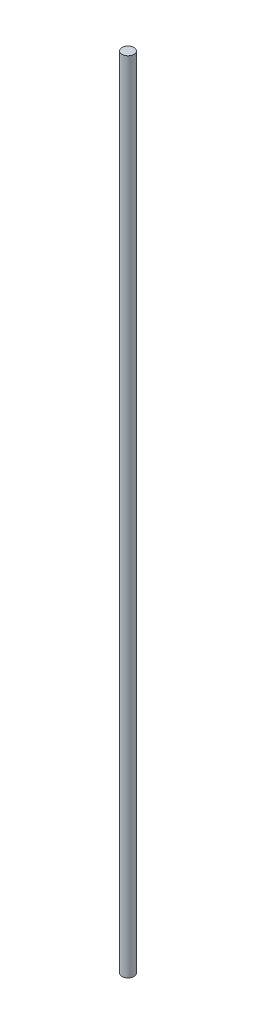
ISO-10303-21;
HEADER;
FILE_DESCRIPTION(('STEP AP214'),'2;1');
FILE_NAME('part.step','',(''),(''),'','','');
FILE_SCHEMA(('AUTOMOTIVE_DESIGN { 1 0 10303 214 1 1 1 1 }'));
ENDSEC;
DATA;
#1=APPLICATION_CONTEXT('core data for automotive mechanical design processes');
#2=APPLICATION_PROTOCOL_DEFINITION('international standard','automotive_design',2000,#1);
#3=PRODUCT_CONTEXT('',#1,'mechanical');
#4=PRODUCT('Part','Part','',(#3));
#5=PRODUCT_RELATED_PRODUCT_CATEGORY('part','',(#4));
#6=PRODUCT_DEFINITION_FORMATION('','',#4);
#7=PRODUCT_DEFINITION_CONTEXT('part definition',#1,'design');
#8=PRODUCT_DEFINITION('design','',#6,#7);
#9=PRODUCT_DEFINITION_SHAPE('','',#8);
#10=(LENGTH_UNIT() NAMED_UNIT(*) SI_UNIT(.MILLI.,.METRE.));
#11=(NAMED_UNIT(*) PLANE_ANGLE_UNIT() SI_UNIT($,.RADIAN.));
#12=(NAMED_UNIT(*) SI_UNIT($,.STERADIAN.) SOLID_ANGLE_UNIT());
#13=UNCERTAINTY_MEASURE_WITH_UNIT(LENGTH_MEASURE(1.E-05),#10,'distance_accuracy_value','');
#14=(GEOMETRIC_REPRESENTATION_CONTEXT(3) GLOBAL_UNCERTAINTY_ASSIGNED_CONTEXT((#13)) GLOBAL_UNIT_ASSIGNED_CONTEXT((#10,
#11,#12)) REPRESENTATION_CONTEXT('',''));
#15=CARTESIAN_POINT('',(0.,0.,0.));
#16=DIRECTION('',(0.,0.,1.));
#17=DIRECTION('',(1.,0.,0.));
#18=AXIS2_PLACEMENT_3D('',#15,#16,#17);
#19=CARTESIAN_POINT('',(0.,99.9999999999994,0.));
#20=DIRECTION('',(0.,-1.,0.));
#21=DIRECTION('',(0.,0.,-1.));
#22=AXIS2_PLACEMENT_3D('',#19,#20,#21);
#23=CYLINDRICAL_SURFACE('',#22,0.75);
#24=CARTESIAN_POINT('',(0.,99.9999999999994,0.));
#25=DIRECTION('',(0.,1.,0.));
#26=DIRECTION('',(0.,0.,1.));
#27=AXIS2_PLACEMENT_3D('',#24,#25,#26);
#28=CIRCLE('',#27,0.75);
#29=CARTESIAN_POINT('',(0.,99.9999999999994,0.75));
#30=VERTEX_POINT('',#29);
#31=EDGE_CURVE('E10',#30,#30,#28,.T.);
#32=ORIENTED_EDGE('',*,*,#31,.F.);
#33=EDGE_LOOP('',(#32));
#34=FACE_BOUND('',#33,.T.);
#35=CARTESIAN_POINT('',(0.,0.,0.));
#36=DIRECTION('',(0.,1.,0.));
#37=DIRECTION('',(0.,0.,1.));
#38=AXIS2_PLACEMENT_3D('',#35,#36,#37);
#39=CIRCLE('',#38,0.75);
#40=CARTESIAN_POINT('',(0.,0.,0.75));
#41=VERTEX_POINT('',#40);
#42=EDGE_CURVE('E40',#41,#41,#39,.T.);
#43=ORIENTED_EDGE('',*,*,#42,.T.);
#44=EDGE_LOOP('',(#43));
#45=FACE_BOUND('',#44,.T.);
#46=ADVANCED_FACE('F37',(#34,#45),#23,.T.);
#47=CARTESIAN_POINT('',(0.,99.9999999999994,0.));
#48=DIRECTION('',(0.,1.,0.));
#49=DIRECTION('',(0.,0.,1.));
#50=AXIS2_PLACEMENT_3D('',#47,#48,#49);
#51=PLANE('',#50);
#52=ORIENTED_EDGE('',*,*,#31,.T.);
#53=EDGE_LOOP('',(#52));
#54=FACE_BOUND('',#53,.T.);
#55=ADVANCED_FACE('F52',(#54),#51,.T.);
#56=CARTESIAN_POINT('',(0.,0.,0.));
#57=DIRECTION('',(0.,1.,0.));
#58=DIRECTION('',(0.,0.,1.));
#59=AXIS2_PLACEMENT_3D('',#56,#57,#58);
#60=PLANE('',#59);
#61=ORIENTED_EDGE('',*,*,#42,.F.);
#62=EDGE_LOOP('',(#61));
#63=FACE_BOUND('',#62,.T.);
#64=ADVANCED_FACE('F50',(#63),#60,.F.);
#65=CLOSED_SHELL('',(#46,#55,#64));
#66=MANIFOLD_SOLID_BREP('B2',#65);
#67=ADVANCED_BREP_SHAPE_REPRESENTATION('',(#18,#66),#14);
#68=SHAPE_DEFINITION_REPRESENTATION(#9,#67);
ENDSEC;
END-ISO-10303-21;
